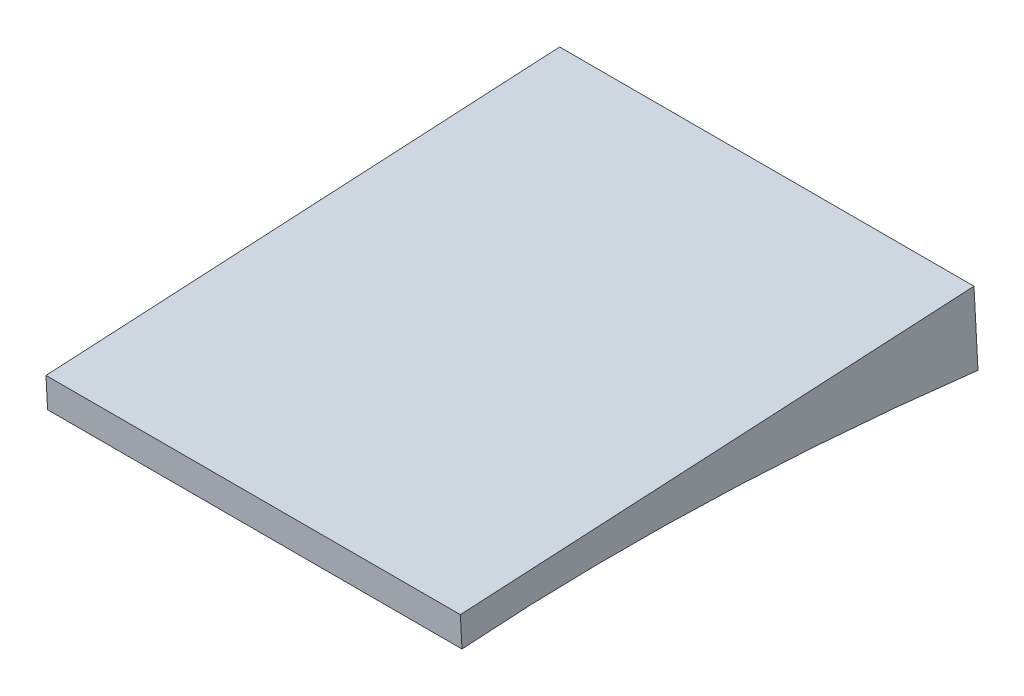
ISO-10303-21;
HEADER;
FILE_DESCRIPTION(('STEP AP214'),'2;1');
FILE_NAME('part.step','',(''),(''),'','','');
FILE_SCHEMA(('AUTOMOTIVE_DESIGN { 1 0 10303 214 1 1 1 1 }'));
ENDSEC;
DATA;
#1=APPLICATION_CONTEXT('core data for automotive mechanical design processes');
#2=APPLICATION_PROTOCOL_DEFINITION('international standard','automotive_design',2000,#1);
#3=PRODUCT_CONTEXT('',#1,'mechanical');
#4=PRODUCT('Part','Part','',(#3));
#5=PRODUCT_RELATED_PRODUCT_CATEGORY('part','',(#4));
#6=PRODUCT_DEFINITION_FORMATION('','',#4);
#7=PRODUCT_DEFINITION_CONTEXT('part definition',#1,'design');
#8=PRODUCT_DEFINITION('design','',#6,#7);
#9=PRODUCT_DEFINITION_SHAPE('','',#8);
#10=(LENGTH_UNIT() NAMED_UNIT(*) SI_UNIT(.MILLI.,.METRE.));
#11=(NAMED_UNIT(*) PLANE_ANGLE_UNIT() SI_UNIT($,.RADIAN.));
#12=(NAMED_UNIT(*) SI_UNIT($,.STERADIAN.) SOLID_ANGLE_UNIT());
#13=UNCERTAINTY_MEASURE_WITH_UNIT(LENGTH_MEASURE(1.E-05),#10,'distance_accuracy_value','');
#14=(GEOMETRIC_REPRESENTATION_CONTEXT(3) GLOBAL_UNCERTAINTY_ASSIGNED_CONTEXT((#13)) GLOBAL_UNIT_ASSIGNED_CONTEXT((#10,
#11,#12)) REPRESENTATION_CONTEXT('',''));
#15=CARTESIAN_POINT('',(0.,0.,0.));
#16=DIRECTION('',(0.,0.,1.));
#17=DIRECTION('',(1.,0.,0.));
#18=AXIS2_PLACEMENT_3D('',#15,#16,#17);
#19=CARTESIAN_POINT('',(-177.805848873745,-43.688210722732,-115.550179040921));
#20=DIRECTION('',(-2.29475219963646E-07,0.0534934907984705,-0.998568198192863));
#21=DIRECTION('',(0.,0.99856819819289,0.053493490798472));
#22=AXIS2_PLACEMENT_3D('',#19,#20,#21);
#23=PLANE('',#22);
#24=CARTESIAN_POINT('',(-177.8,74.4222867999415,-109.222976930415));
#25=CARTESIAN_POINT('',(-204.737386779382,74.4223060552666,-109.222969708578));
#26=CARTESIAN_POINT('',(-231.674773558716,74.4222945833738,-109.222964132803));
#27=CARTESIAN_POINT('',(-285.549547117384,74.4222101851525,-109.22295627338));
#28=CARTESIAN_POINT('',(-312.486933896718,74.4221372588239,-109.222953989731));
#29=CARTESIAN_POINT('',(-339.424320676004,74.4220336052774,-109.222953352146));
#30=B_SPLINE_CURVE_WITH_KNOTS('',3,(#24,#25,#26,#27,#28,#29),.UNSPECIFIED.,.F.,.F.,(4,2,4),(0.,
80.8121603380111,161.62432067631),.UNSPECIFIED.);
#31=CARTESIAN_POINT('',(-177.8,74.4222867999415,-109.222976930415));
#32=VERTEX_POINT('',#31);
#33=CARTESIAN_POINT('',(-338.178267081434,74.4220392812844,-109.222953334448));
#34=VERTEX_POINT('',#33);
#35=EDGE_CURVE('E102',#32,#34,#30,.T.);
#36=ORIENTED_EDGE('',*,*,#35,.T.);
#37=DIRECTION('',(0.0023746530409731,0.998565382766486,0.0534933394298316));
#38=VECTOR('',#37,1.);
#39=CARTESIAN_POINT('',(-338.458234976646,-43.3072641668652,-115.529734741914));
#40=LINE('',#39,#38);
#41=CARTESIAN_POINT('',(-338.20642601368,62.5809262970695,-109.857284032272));
#42=VERTEX_POINT('',#41);
#43=EDGE_CURVE('E11',#42,#34,#40,.T.);
#44=ORIENTED_EDGE('',*,*,#43,.F.);
#45=CARTESIAN_POINT('',(-339.424320676004,62.5809262763675,-109.857283753503));
#46=CARTESIAN_POINT('',(-285.549547117336,62.5809271921398,-109.857296085097));
#47=CARTESIAN_POINT('',(-231.674773558668,62.5809281079121,-109.857308416692));
#48=CARTESIAN_POINT('',(-177.8,62.5809290236845,-109.857320748286));
#49=B_SPLINE_CURVE_WITH_KNOTS('',3,(#45,#46,#47,#48),.UNSPECIFIED.,.F.,.F.,(4,4),(0.,
161.624320676009),.UNSPECIFIED.);
#50=CARTESIAN_POINT('',(-177.8,62.5809290234087,-109.857320744572));
#51=VERTEX_POINT('',#50);
#52=EDGE_CURVE('E100',#42,#51,#49,.T.);
#53=ORIENTED_EDGE('',*,*,#52,.T.);
#54=DIRECTION('',(0.,-0.99856819819289,-0.053493490798472));
#55=VECTOR('',#54,1.);
#56=CARTESIAN_POINT('',(-177.8,6.04731605634461,-112.885837288814));
#57=LINE('',#56,#55);
#58=EDGE_CURVE('E88',#32,#51,#57,.T.);
#59=ORIENTED_EDGE('',*,*,#58,.F.);
#60=EDGE_LOOP('',(#36,#44,#53,#59));
#61=FACE_BOUND('',#60,.T.);
#62=ADVANCED_FACE('F42',(#61),#23,.F.);
#63=CARTESIAN_POINT('',(-338.458280662959,-32.6572237938514,-314.335074741631));
#64=DIRECTION('',(-0.999997180507466,0.0023712407330619,0.000127257626607295));
#65=DIRECTION('',(-0.00237124075226243,-0.999997188604695,0.));
#66=AXIS2_PLACEMENT_3D('',#63,#64,#65);
#67=PLANE('',#66);
#68=CARTESIAN_POINT('',(-338.178218954045,85.516750306757,-315.576821091204));
#69=CARTESIAN_POINT('',(-338.178235236539,81.7631823624267,-245.763081881881));
#70=CARTESIAN_POINT('',(-338.178251519032,78.0096144180964,-175.949342672558));
#71=CARTESIAN_POINT('',(-338.178267801526,74.2560464737662,-106.135603463235));
#72=B_SPLINE_CURVE_WITH_KNOTS('',3,(#68,#69,#70,#71),.UNSPECIFIED.,.F.,.F.,(4,4),(0.,
209.743717646806),.UNSPECIFIED.);
#73=CARTESIAN_POINT('',(-338.178220714968,85.1107887697366,-308.026219679411));
#74=VERTEX_POINT('',#73);
#75=EDGE_CURVE('E114',#74,#34,#72,.T.);
#76=ORIENTED_EDGE('',*,*,#75,.F.);
#77=DIRECTION('',(0.0023746530409731,0.998565382766486,0.0534933394298316));
#78=VECTOR('',#77,1.);
#79=CARTESIAN_POINT('',(-338.458280662959,-32.6572237938514,-314.335074741631));
#80=LINE('',#79,#78);
#81=CARTESIAN_POINT('',(-338.247088528495,56.1511835604797,-309.577591295045));
#82=VERTEX_POINT('',#81);
#83=EDGE_CURVE('E48',#82,#74,#80,.T.);
#84=ORIENTED_EDGE('',*,*,#83,.F.);
#85=CARTESIAN_POINT('',(-338.206630211542,62.2950803630914,-106.135603463235));
#86=CARTESIAN_POINT('',(-338.206452588991,62.5264130517818,-109.050347782844));
#87=CARTESIAN_POINT('',(-338.206316703682,62.7402180505337,-111.966465316779));
#88=CARTESIAN_POINT('',(-338.206125108084,63.1341369909732,-117.800941406559));
#89=CARTESIAN_POINT('',(-338.206069396801,63.3142513505074,-120.719299934159));
#90=CARTESIAN_POINT('',(-338.206034874827,63.6418811395184,-126.552877409027));
#91=CARTESIAN_POINT('',(-338.206055933966,63.7894512998445,-129.468093294816));
#92=CARTESIAN_POINT('',(-338.206171677361,64.053618164659,-135.299934725794));
#93=CARTESIAN_POINT('',(-338.206266361867,64.1702147642243,-138.216560275725));
#94=CARTESIAN_POINT('',(-338.206526879844,64.3732713998943,-144.047357438116));
#95=CARTESIAN_POINT('',(-338.20669262792,64.4597673818697,-146.96152780298));
#96=CARTESIAN_POINT('',(-338.207092835108,64.6038206521406,-152.790577596594));
#97=CARTESIAN_POINT('',(-338.207327294155,64.6613779680298,-155.705457024666));
#98=CARTESIAN_POINT('',(-338.207862299915,64.7485206121415,-161.533323365936));
#99=CARTESIAN_POINT('',(-338.208162794181,64.7781280407748,-164.446309951297));
#100=CARTESIAN_POINT('',(-338.208827645186,64.8104187907757,-170.27243049633));
#101=CARTESIAN_POINT('',(-338.209192001942,64.8131021058322,-173.185564456036));
#102=CARTESIAN_POINT('',(-338.209982729134,64.7922394293119,-179.010398329726));
#103=CARTESIAN_POINT('',(-338.210409071009,64.7687054849597,-181.92209828779));
#104=CARTESIAN_POINT('',(-338.21132217205,64.6961412998232,-187.745178087266));
#105=CARTESIAN_POINT('',(-338.211808931209,64.6471110617968,-190.656557928712));
#106=CARTESIAN_POINT('',(-338.212841077316,64.5242696703842,-196.478265485657));
#107=CARTESIAN_POINT('',(-338.213386453638,64.4504630039913,-199.388593296211));
#108=CARTESIAN_POINT('',(-338.214534178347,64.2787852867441,-205.208537425427));
#109=CARTESIAN_POINT('',(-338.215136526736,64.1809142352243,-208.118153744069));
#110=CARTESIAN_POINT('',(-338.216396691932,63.9616705564845,-213.93534617008));
#111=CARTESIAN_POINT('',(-338.217054486689,63.8403072471177,-216.842922629145));
#112=CARTESIAN_POINT('',(-338.218424543045,63.5745543796456,-222.657021860731));
#113=CARTESIAN_POINT('',(-338.219136804647,63.4301648204513,-225.563544633202));
#114=CARTESIAN_POINT('',(-338.220614856571,63.1188049682522,-231.376466123578));
#115=CARTESIAN_POINT('',(-338.221380666755,62.951826274975,-234.28286439106));
#116=CARTESIAN_POINT('',(-338.222964361378,62.5958356261063,-240.094308865015));
#117=CARTESIAN_POINT('',(-338.223782245799,62.406823678605,-242.999355071985));
#118=CARTESIAN_POINT('',(-338.225469455636,62.0071226085391,-248.809754350172));
#119=CARTESIAN_POINT('',(-338.226338812456,61.7964201936952,-251.715106506422));
#120=CARTESIAN_POINT('',(-338.22812738411,61.3539030387979,-257.524203602641));
#121=CARTESIAN_POINT('',(-338.229046598995,61.1220882777029,-260.427948541005));
#122=CARTESIAN_POINT('',(-338.230934535536,60.6376181706382,-266.236134548848));
#123=CARTESIAN_POINT('',(-338.23190329776,60.3849456396141,-269.140574186221));
#124=CARTESIAN_POINT('',(-338.233392198962,59.9907830033618,-273.495853471107));
#125=CARTESIAN_POINT('',(-338.23389445894,59.8568698359745,-274.94738301981));
#126=CARTESIAN_POINT('',(-338.234910742211,59.5840575839914,-277.849974330581));
#127=CARTESIAN_POINT('',(-338.235424765505,59.4451584990211,-279.301036092614));
#128=CARTESIAN_POINT('',(-338.236465337835,59.1621318575131,-282.204163434511));
#129=CARTESIAN_POINT('',(-338.236991899267,59.0179990460408,-283.656228502042));
#130=CARTESIAN_POINT('',(-338.238057307689,58.7245241097907,-286.55983204049));
#131=CARTESIAN_POINT('',(-338.238596154677,58.5751819857544,-288.011370511483));
#132=CARTESIAN_POINT('',(-338.239686344853,58.2711983032512,-290.91389684554));
#133=CARTESIAN_POINT('',(-338.240237688077,58.1165567297172,-292.364884707027));
#134=CARTESIAN_POINT('',(-338.241353289527,57.8017951573181,-295.266265569462));
#135=CARTESIAN_POINT('',(-338.241917547748,57.6416751601103,-296.716658570589));
#136=CARTESIAN_POINT('',(-338.243058749268,57.316148300317,-299.618612365171));
#137=CARTESIAN_POINT('',(-338.243635706972,57.150735325704,-301.070172472183));
#138=CARTESIAN_POINT('',(-338.244800210271,56.815416461967,-303.972774674875));
#139=CARTESIAN_POINT('',(-338.245387755878,56.6455105677041,-305.423816769961));
#140=CARTESIAN_POINT('',(-338.24657211609,56.3017643804209,-308.325426063246));
#141=CARTESIAN_POINT('',(-338.247168930642,56.1279241099069,-309.775993264114));
#142=CARTESIAN_POINT('',(-338.248070094079,55.8646414737298,-311.951535840581));
#143=CARTESIAN_POINT('',(-338.248371471685,55.7764603628275,-312.676664197412));
#144=CARTESIAN_POINT('',(-338.248824897268,55.643611720786,-313.764286186712));
#145=CARTESIAN_POINT('',(-338.248976265639,55.5992326828442,-314.126815048709));
#146=CARTESIAN_POINT('',(-338.249279583928,55.5102277332537,-314.851842493964));
#147=CARTESIAN_POINT('',(-338.249431533846,55.465601821582,-315.214341077219));
#148=CARTESIAN_POINT('',(-338.249583838759,55.420825204647,-315.576821091204));
#149=B_SPLINE_CURVE_WITH_KNOTS('',3,(#85,#86,#87,#88,#89,#90,#91,#92,#93,#94,#95,#96,#97,#98,
#99,#100,#101,#102,#103,#104,#105,#106,#107,#108,#109,#110,#111,#112,#113,#114,#115,#116,#117,
#118,#119,#120,#121,#122,#123,#124,#125,#126,#127,#128,#129,#130,#131,#132,#133,#134,#135,#136,
#137,#138,#139,#140,#141,#142,#143,#144,#145,#146,#147,#148),.UNSPECIFIED.,.F.,.F.,(4,2,2,2,2,2,
2,2,2,2,2,2,2,2,2,2,2,2,2,2,2,2,2,2,2,2,2,2,2,2,2,4),(0.,8.77165086322876,17.5431929292901,
26.299869113779,35.0565749612163,43.802787457334,52.5489916137688,61.2882742034789,
70.0275588417237,78.7628293032497,87.4980988198531,96.2317872380297,104.965475897692,
113.695707542152,122.425939599537,131.159427158401,139.892911510474,148.631780112311,
157.370657423853,166.116808111122,170.489882343153,174.86295690364,179.240550745115,
183.618143963467,187.995749628911,192.373353970173,196.756209973982,201.139070991106,
205.521906942761,207.713318080027,208.809023386018,209.904728793854),.UNSPECIFIED.);
#150=EDGE_CURVE('E107',#42,#82,#149,.T.);
#151=ORIENTED_EDGE('',*,*,#150,.F.);
#152=ORIENTED_EDGE('',*,*,#43,.T.);
#153=EDGE_LOOP('',(#76,#84,#151,#152));
#154=FACE_BOUND('',#153,.T.);
#155=ADVANCED_FACE('F136',(#154),#67,.T.);
#156=CARTESIAN_POINT('',(-177.805940246243,-33.0381702413849,-314.355519034823));
#157=DIRECTION('',(-2.29475219526301E-07,0.0534934907984705,-0.998568198192863));
#158=DIRECTION('',(0.,0.99856819819289,0.053493490798472));
#159=AXIS2_PLACEMENT_3D('',#156,#157,#158);
#160=PLANE('',#159);
#161=CARTESIAN_POINT('',(-177.8,85.110750331542,-308.026258594133));
#162=CARTESIAN_POINT('',(-204.737394348035,85.1107449085178,-308.026252694317));
#163=CARTESIAN_POINT('',(-231.674788696068,85.1107454911889,-308.026246472776));
#164=CARTESIAN_POINT('',(-285.549577392135,85.1107586679218,-308.02623338624));
#165=CARTESIAN_POINT('',(-312.486971740168,85.1107712619836,-308.026226521246));
#166=CARTESIAN_POINT('',(-339.4243660882,85.1107898617407,-308.026219334526));
#167=B_SPLINE_CURVE_WITH_KNOTS('',3,(#161,#162,#163,#164,#165,#166),.UNSPECIFIED.,.F.,.F.,(4,2,
4),(0.,80.8121830441022,161.624366088213),.UNSPECIFIED.);
#168=CARTESIAN_POINT('',(-177.8,85.110750331542,-308.026258594133));
#169=VERTEX_POINT('',#168);
#170=EDGE_CURVE('E69',#169,#74,#167,.T.);
#171=ORIENTED_EDGE('',*,*,#170,.F.);
#172=DIRECTION('',(0.,-0.99856819819289,-0.053493490798472));
#173=VECTOR('',#172,1.);
#174=CARTESIAN_POINT('',(-177.8,16.697356429359,-311.691177288541));
#175=LINE('',#174,#173);
#176=CARTESIAN_POINT('',(-177.8,56.1511791040107,-309.577628401668));
#177=VERTEX_POINT('',#176);
#178=EDGE_CURVE('E97',#169,#177,#175,.T.);
#179=ORIENTED_EDGE('',*,*,#178,.T.);
#180=CARTESIAN_POINT('',(-339.4243660882,56.15118359318,-309.577591022767));
#181=CARTESIAN_POINT('',(-285.549577392133,56.1511820966472,-309.577603483592));
#182=CARTESIAN_POINT('',(-231.674788696067,56.1511806001143,-309.577615944417));
#183=CARTESIAN_POINT('',(-177.8,56.1511791035814,-309.577628405242));
#184=B_SPLINE_CURVE_WITH_KNOTS('',3,(#180,#181,#182,#183),.UNSPECIFIED.,.F.,.F.,(4,4),(0.,
161.624366088204),.UNSPECIFIED.);
#185=EDGE_CURVE('E62',#82,#177,#184,.T.);
#186=ORIENTED_EDGE('',*,*,#185,.F.);
#187=ORIENTED_EDGE('',*,*,#83,.T.);
#188=EDGE_LOOP('',(#171,#179,#186,#187));
#189=FACE_BOUND('',#188,.T.);
#190=ADVANCED_FACE('F132',(#189),#160,.T.);
#191=CARTESIAN_POINT('',(-177.8,0.,0.));
#192=DIRECTION('',(-1.,0.,0.));
#193=DIRECTION('',(0.,0.,1.));
#194=AXIS2_PLACEMENT_3D('',#191,#192,#193);
#195=PLANE('',#194);
#196=DIRECTION('',(0.,0.0536864833252265,-0.998557840842567));
#197=VECTOR('',#196,1.);
#198=CARTESIAN_POINT('',(-177.8,65.8781508423885,49.6962411892494));
#199=LINE('',#198,#197);
#200=EDGE_CURVE('E92',#32,#169,#199,.T.);
#201=ORIENTED_EDGE('',*,*,#200,.F.);
#202=ORIENTED_EDGE('',*,*,#58,.T.);
#203=CARTESIAN_POINT('',(-177.8,-4.63504372721387,-486.265240325771));
#204=CARTESIAN_POINT('',(-177.8,1.83078834545628,-475.798604619994));
#205=CARTESIAN_POINT('',(-177.8,13.88926974822,-454.312764268715));
#206=CARTESIAN_POINT('',(-177.8,29.2245092391949,-420.690900195696));
#207=CARTESIAN_POINT('',(-177.8,39.4662975955996,-391.639559871781));
#208=CARTESIAN_POINT('',(-177.8,46.0383471864307,-367.906811920152));
#209=CARTESIAN_POINT('',(-177.8,50.1289716166113,-349.897665028212));
#210=CARTESIAN_POINT('',(-177.8,53.3958988659329,-331.712828111795));
#211=CARTESIAN_POINT('',(-177.8,55.714700607055,-313.408651411274));
#212=CARTESIAN_POINT('',(-177.8,57.8672725021249,-295.107197371007));
#213=CARTESIAN_POINT('',(-177.8,60.3514671040502,-270.6545199273));
#214=CARTESIAN_POINT('',(-177.8,62.7920862835124,-240.027554240449));
#215=CARTESIAN_POINT('',(-177.8,64.5518412881872,-203.195919164225));
#216=CARTESIAN_POINT('',(-177.8,65.0284962278422,-166.320848877817));
#217=CARTESIAN_POINT('',(-177.8,64.0618587849313,-129.448182963541));
#218=CARTESIAN_POINT('',(-177.8,61.4272131768156,-92.6473789600514));
#219=CARTESIAN_POINT('',(-177.8,57.5903132654066,-62.1278910615713));
#220=CARTESIAN_POINT('',(-177.8,53.2997551007173,-37.896239171482));
#221=CARTESIAN_POINT('',(-177.8,49.3855068860328,-19.8527900849958));
#222=CARTESIAN_POINT('',(-177.8,44.6602421800703,-1.99498265798601));
#223=CARTESIAN_POINT('',(-177.8,39.9109380351398,12.6617143775167));
#224=CARTESIAN_POINT('',(-177.8,35.489238489374,24.1743679264121));
#225=CARTESIAN_POINT('',(-177.8,31.8084283862062,32.6687242753332));
#226=CARTESIAN_POINT('',(-177.8,27.6918547943622,40.974488962412));
#227=CARTESIAN_POINT('',(-177.8,23.0319323917029,49.0126857131575));
#228=CARTESIAN_POINT('',(-177.8,17.6580792712106,56.6339395967455));
#229=CARTESIAN_POINT('',(-177.8,12.3453248319818,62.404116232879));
#230=CARTESIAN_POINT('',(-177.8,7.32735483393856,66.2701140204816));
#231=CARTESIAN_POINT('',(-177.8,3.09941750836411,68.5714980011858));
#232=CARTESIAN_POINT('',(-177.8,-0.452354776864283,69.5610109929074));
#233=CARTESIAN_POINT('',(-177.8,-2.88445310451718,69.7917971271235));
#234=CARTESIAN_POINT('',(-177.8,-4.12527062577326,69.8176285587099));
#235=CARTESIAN_POINT('',(-177.8,-5.36659154709746,69.7196954311463));
#236=CARTESIAN_POINT('',(-177.8,-6.13001958673486,69.6175918349424));
#237=CARTESIAN_POINT('',(-177.8,-6.51913907058263,69.5663617744474));
#238=B_SPLINE_CURVE_WITH_KNOTS('',3,(#203,#204,#205,#206,#207,#208,#209,#210,#211,#212,#213,
#214,#215,#216,#217,#218,#219,#220,#221,#222,#223,#224,#225,#226,#227,#228,#229,#230,#231,#232,
#233,#234,#235,#236,#237),.UNSPECIFIED.,.F.,.F.,(4,1,1,1,1,1,1,1,1,1,1,1,1,1,1,1,1,1,1,1,1,1,1,
1,1,1,1,1,1,1,1,1,4),(0.,0.0625041235375069,0.125008247075014,0.187512370612521,
0.218764432381274,0.250016494150027,0.281268555918781,0.312520617687534,0.343772679456288,
0.375024741225041,0.437528864762549,0.500032988300055,0.562537111837562,0.625041235375069,
0.687545358912576,0.750049482450083,0.781301544218836,0.81255360598759,0.843805667756343,
0.875057729525097,0.890683760409473,0.90630979129385,0.921935822178227,0.937561853062603,
0.95318788394698,0.968813914831357,0.976626930273545,0.984439945715734,0.992252961157922,
0.994206215018469,0.996159468879016,0.998112722739563,1.00006597660011),.UNSPECIFIED.);
#239=EDGE_CURVE('E54',#177,#51,#238,.T.);
#240=ORIENTED_EDGE('',*,*,#239,.F.);
#241=ORIENTED_EDGE('',*,*,#178,.F.);
#242=EDGE_LOOP('',(#201,#202,#240,#241));
#243=FACE_BOUND('',#242,.T.);
#244=ADVANCED_FACE('F90',(#243),#195,.F.);
#245=CARTESIAN_POINT('',(-177.8,65.8781508423885,49.6962411892493));
#246=CARTESIAN_POINT('',(-231.516137288527,65.8787970451198,49.684221947819));
#247=CARTESIAN_POINT('',(-328.898817793057,65.8799587745919,49.6624290270975));
#248=CARTESIAN_POINT('',(-430.301749554133,65.8795676334247,49.6392318840312));
#249=CARTESIAN_POINT('',(-478.536378495178,65.8944796643632,49.6329561991434));
#250=CARTESIAN_POINT('',(-484.553750526313,65.8801569539115,49.62707278082));
#251=CARTESIAN_POINT('',(-485.331531687459,65.8700020364117,49.6236952041893));
#252=CARTESIAN_POINT('',(-485.744527490584,65.8838878926665,49.627977729598));
#253=CARTESIAN_POINT('',(-486.040270716771,65.8993784286855,49.6327926933882));
#254=CARTESIAN_POINT('',(-486.556396633948,65.9602372100236,49.651856532687));
#255=CARTESIAN_POINT('',(-487.317873690559,66.0137555468449,49.6685510047104));
#256=CARTESIAN_POINT('',(-488.239730119881,66.0950282411789,49.6939565152748));
#257=CARTESIAN_POINT('',(-489.559339697561,66.2103395815435,49.7299997134027));
#258=CARTESIAN_POINT('',(-490.486101932218,66.2905952519518,49.7550835652258));
#259=CARTESIAN_POINT('',(-491.107536578648,66.3445114865218,49.7719353115469));
#260=CARTESIAN_POINT('',(-177.8,74.6548216331163,-113.548078269781));
#261=CARTESIAN_POINT('',(-231.579974335744,74.655252434937,-113.556091097401));
#262=CARTESIAN_POINT('',(-329.085323869404,74.6560228824289,-113.570620546676));
#263=CARTESIAN_POINT('',(-430.425747152048,74.6560404333492,-113.586027737782));
#264=CARTESIAN_POINT('',(-478.552015447206,74.6690366969826,-113.589579595877));
#265=CARTESIAN_POINT('',(-484.557146346177,74.6551946697141,-113.594390029726));
#266=CARTESIAN_POINT('',(-485.334083909181,74.6445154674445,-113.597450407754));
#267=CARTESIAN_POINT('',(-485.744700304045,74.6598119040633,-113.593346135502));
#268=CARTESIAN_POINT('',(-486.032139732393,74.6761191709517,-113.588899099885));
#269=CARTESIAN_POINT('',(-486.482546738094,74.7359898087317,-113.572197908095));
#270=CARTESIAN_POINT('',(-487.138956506633,74.7871913881035,-113.55785727129));
#271=CARTESIAN_POINT('',(-487.922810441756,74.8606870318585,-113.536925044651));
#272=CARTESIAN_POINT('',(-489.038035338706,74.9653658189383,-113.507144656348));
#273=CARTESIAN_POINT('',(-489.817904728499,75.0386262870922,-113.486335263897));
#274=CARTESIAN_POINT('',(-490.341175821834,75.0877184236467,-113.472381004376));
#275=CARTESIAN_POINT('',(-177.8,83.4314924238441,-276.792397728811));
#276=CARTESIAN_POINT('',(-231.64381138296,83.4317078247542,-276.79640414262));
#277=CARTESIAN_POINT('',(-329.271829945751,83.4320869902656,-276.80367012045));
#278=CARTESIAN_POINT('',(-430.549744749963,83.4325132332734,-276.811287359595));
#279=CARTESIAN_POINT('',(-478.567652399233,83.4435937296021,-276.812115390897));
#280=CARTESIAN_POINT('',(-484.560542166041,83.4302323855168,-276.815852840272));
#281=CARTESIAN_POINT('',(-485.336636130903,83.4190288984773,-276.818596019698));
#282=CARTESIAN_POINT('',(-485.744873117508,83.4357359154601,-276.814670000602));
#283=CARTESIAN_POINT('',(-486.024008748016,83.452859913218,-276.810590893159));
#284=CARTESIAN_POINT('',(-486.408696842241,83.5117424074398,-276.796252348878));
#285=CARTESIAN_POINT('',(-486.960039322706,83.5606272293622,-276.784265547289));
#286=CARTESIAN_POINT('',(-487.605890763631,83.6263458225381,-276.767806604576));
#287=CARTESIAN_POINT('',(-488.51673097985,83.7203920563331,-276.744289026098));
#288=CARTESIAN_POINT('',(-489.14970752478,83.7866573222327,-276.72775409302));
#289=CARTESIAN_POINT('',(-489.57481506502,83.8309253607717,-276.716697320298));
#290=CARTESIAN_POINT('',(-177.8,92.2081632145719,-440.036717187841));
#291=CARTESIAN_POINT('',(-231.707648430177,92.2081632145713,-440.03671718784));
#292=CARTESIAN_POINT('',(-329.458336022097,92.2081510981023,-440.036719694223));
#293=CARTESIAN_POINT('',(-430.673742347878,92.2089860331975,-440.036546981408));
#294=CARTESIAN_POINT('',(-478.58328935126,92.2181507622215,-440.034651185918));
#295=CARTESIAN_POINT('',(-484.563937985906,92.2052701013194,-440.037315650818));
#296=CARTESIAN_POINT('',(-485.339188352625,92.1935423295101,-440.039741631642));
#297=CARTESIAN_POINT('',(-485.74504593097,92.211659926857,-440.035993865702));
#298=CARTESIAN_POINT('',(-486.015877763639,92.2296006554842,-440.032282686432));
#299=CARTESIAN_POINT('',(-486.334846946387,92.2874950061478,-440.02030678966));
#300=CARTESIAN_POINT('',(-486.781122138779,92.3340630706208,-440.010673823289));
#301=CARTESIAN_POINT('',(-487.288971085506,92.3920046132177,-439.998688164502));
#302=CARTESIAN_POINT('',(-487.995426620994,92.4754182937279,-439.981433395848));
#303=CARTESIAN_POINT('',(-488.481510321061,92.5346883573731,-439.969172922142));
#304=CARTESIAN_POINT('',(-488.808454308207,92.5741322978967,-439.961013636221));
#305=B_SPLINE_SURFACE_WITH_KNOTS('',3,3,((#245,#246,#247,#248,#249,#250,#251,#252,#253,#254,
#255,#256,#257,#258,#259),(#260,#261,#262,#263,#264,#265,#266,#267,#268,#269,#270,#271,#272,
#273,#274),(#275,#276,#277,#278,#279,#280,#281,#282,#283,#284,#285,#286,#287,#288,#289),(#290,
#291,#292,#293,#294,#295,#296,#297,#298,#299,#300,#301,#302,#303,#304)),.UNSPECIFIED.,.F.,.F.,
.F.,(4,4),(4,1,1,1,1,1,1,1,1,1,1,1,4),(0.,1.),(0.,0.5,0.90625,0.95703125,0.9609375,0.9638671875,
0.96450845898134,0.96484375,0.966796875,0.970703125,0.9765625,0.984375,1.),.UNSPECIFIED.);
#306=ORIENTED_EDGE('',*,*,#200,.T.);
#307=ORIENTED_EDGE('',*,*,#170,.T.);
#308=ORIENTED_EDGE('',*,*,#75,.T.);
#309=ORIENTED_EDGE('',*,*,#35,.F.);
#310=EDGE_LOOP('',(#306,#307,#308,#309));
#311=FACE_BOUND('',#310,.T.);
#312=ADVANCED_FACE('F151',(#311),#305,.T.);
#313=DIRECTION('',(-1.,0.,0.));
#314=VECTOR('',#313,1.);
#315=SURFACE_OF_LINEAR_EXTRUSION('',#238,#314);
#316=ORIENTED_EDGE('',*,*,#150,.T.);
#317=ORIENTED_EDGE('',*,*,#185,.T.);
#318=ORIENTED_EDGE('',*,*,#239,.T.);
#319=ORIENTED_EDGE('',*,*,#52,.F.);
#320=EDGE_LOOP('',(#316,#317,#318,#319));
#321=FACE_BOUND('',#320,.T.);
#322=ADVANCED_FACE('F44',(#321),#315,.T.);
#323=CLOSED_SHELL('',(#62,#155,#190,#244,#312,#322));
#324=MANIFOLD_SOLID_BREP('B2',#323);
#325=ADVANCED_BREP_SHAPE_REPRESENTATION('',(#18,#324),#14);
#326=SHAPE_DEFINITION_REPRESENTATION(#9,#325);
ENDSEC;
END-ISO-10303-21;
